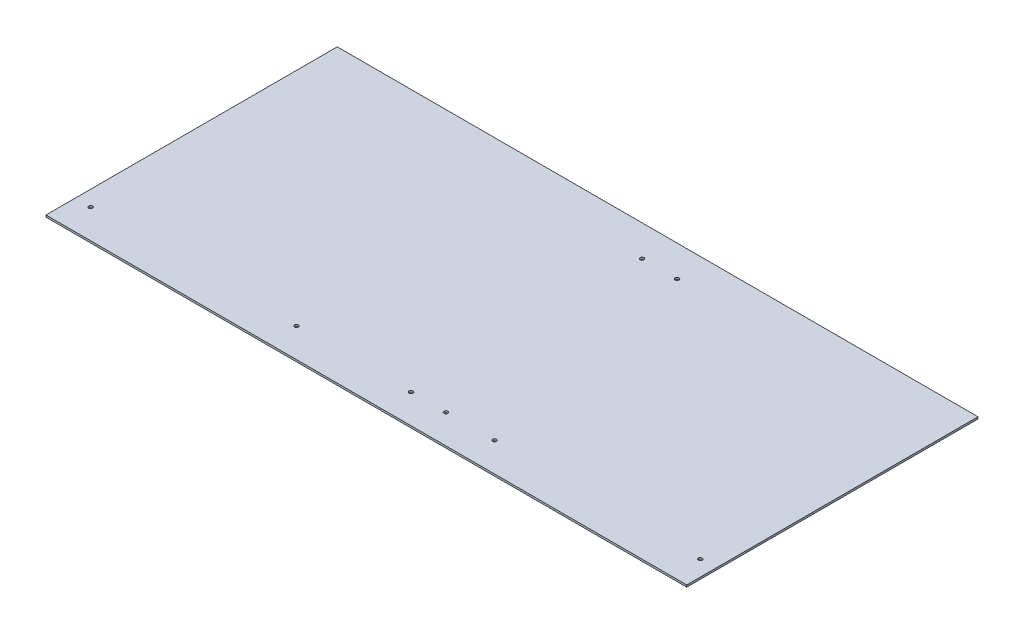
ISO-10303-21;
HEADER;
FILE_DESCRIPTION(('STEP AP214'),'2;1');
FILE_NAME('part.step','',(''),(''),'','','');
FILE_SCHEMA(('AUTOMOTIVE_DESIGN { 1 0 10303 214 1 1 1 1 }'));
ENDSEC;
DATA;
#1=APPLICATION_CONTEXT('core data for automotive mechanical design processes');
#2=APPLICATION_PROTOCOL_DEFINITION('international standard','automotive_design',2000,#1);
#3=PRODUCT_CONTEXT('',#1,'mechanical');
#4=PRODUCT('Part','Part','',(#3));
#5=PRODUCT_RELATED_PRODUCT_CATEGORY('part','',(#4));
#6=PRODUCT_DEFINITION_FORMATION('','',#4);
#7=PRODUCT_DEFINITION_CONTEXT('part definition',#1,'design');
#8=PRODUCT_DEFINITION('design','',#6,#7);
#9=PRODUCT_DEFINITION_SHAPE('','',#8);
#10=(LENGTH_UNIT() NAMED_UNIT(*) SI_UNIT(.MILLI.,.METRE.));
#11=(NAMED_UNIT(*) PLANE_ANGLE_UNIT() SI_UNIT($,.RADIAN.));
#12=(NAMED_UNIT(*) SI_UNIT($,.STERADIAN.) SOLID_ANGLE_UNIT());
#13=UNCERTAINTY_MEASURE_WITH_UNIT(LENGTH_MEASURE(1.E-05),#10,'distance_accuracy_value','');
#14=(GEOMETRIC_REPRESENTATION_CONTEXT(3) GLOBAL_UNCERTAINTY_ASSIGNED_CONTEXT((#13)) GLOBAL_UNIT_ASSIGNED_CONTEXT((#10,
#11,#12)) REPRESENTATION_CONTEXT('',''));
#15=CARTESIAN_POINT('',(0.,0.,0.));
#16=DIRECTION('',(0.,0.,1.));
#17=DIRECTION('',(1.,0.,0.));
#18=AXIS2_PLACEMENT_3D('',#15,#16,#17);
#19=CARTESIAN_POINT('',(5026.025,-3.175,238.125));
#20=DIRECTION('',(0.,-1.,0.));
#21=DIRECTION('',(0.,0.,-1.));
#22=AXIS2_PLACEMENT_3D('',#19,#20,#21);
#23=PLANE('',#22);
#24=DIRECTION('',(0.,0.,1.));
#25=VECTOR('',#24,1.);
#26=CARTESIAN_POINT('',(5549.9,-3.175,238.125));
#27=LINE('',#26,#25);
#28=CARTESIAN_POINT('',(5549.9,-3.175,0.));
#29=VERTEX_POINT('',#28);
#30=CARTESIAN_POINT('',(5549.9,-3.175,476.25));
#31=VERTEX_POINT('',#30);
#32=EDGE_CURVE('E58',#29,#31,#27,.T.);
#33=ORIENTED_EDGE('',*,*,#32,.T.);
#34=DIRECTION('',(1.,0.,0.));
#35=VECTOR('',#34,1.);
#36=CARTESIAN_POINT('',(5026.025,-3.175,476.25));
#37=LINE('',#36,#35);
#38=CARTESIAN_POINT('',(4502.15,-3.175,476.25));
#39=VERTEX_POINT('',#38);
#40=EDGE_CURVE('E50',#39,#31,#37,.T.);
#41=ORIENTED_EDGE('',*,*,#40,.F.);
#42=DIRECTION('',(0.,0.,1.));
#43=VECTOR('',#42,1.);
#44=CARTESIAN_POINT('',(4502.15,-3.175,238.125));
#45=LINE('',#44,#43);
#46=CARTESIAN_POINT('',(4502.15,-3.175,0.));
#47=VERTEX_POINT('',#46);
#48=EDGE_CURVE('E60',#47,#39,#45,.T.);
#49=ORIENTED_EDGE('',*,*,#48,.F.);
#50=DIRECTION('',(1.,0.,0.));
#51=VECTOR('',#50,1.);
#52=CARTESIAN_POINT('',(5026.025,-3.175,0.));
#53=LINE('',#52,#51);
#54=EDGE_CURVE('E55',#47,#29,#53,.T.);
#55=ORIENTED_EDGE('',*,*,#54,.T.);
#56=EDGE_LOOP('',(#33,#41,#49,#55));
#57=FACE_BOUND('',#56,.T.);
#58=CARTESIAN_POINT('',(4527.55,-3.17499999999971,428.625));
#59=DIRECTION('',(0.,-1.,0.));
#60=DIRECTION('',(0.,0.,-1.));
#61=AXIS2_PLACEMENT_3D('',#58,#59,#60);
#62=CIRCLE('',#61,3.175);
#63=CARTESIAN_POINT('',(4527.55,-3.17499999999971,425.45));
#64=VERTEX_POINT('',#63);
#65=EDGE_CURVE('E66',#64,#64,#62,.F.);
#66=ORIENTED_EDGE('',*,*,#65,.T.);
#67=EDGE_LOOP('',(#66));
#68=FACE_BOUND('',#67,.T.);
#69=CARTESIAN_POINT('',(5051.425,-3.17499999999971,428.625));
#70=DIRECTION('',(0.,-1.,0.));
#71=DIRECTION('',(0.,0.,-1.));
#72=AXIS2_PLACEMENT_3D('',#69,#70,#71);
#73=CIRCLE('',#72,3.175);
#74=CARTESIAN_POINT('',(5051.425,-3.17499999999971,425.45));
#75=VERTEX_POINT('',#74);
#76=EDGE_CURVE('E106',#75,#75,#73,.F.);
#77=ORIENTED_EDGE('',*,*,#76,.T.);
#78=EDGE_LOOP('',(#77));
#79=FACE_BOUND('',#78,.T.);
#80=CARTESIAN_POINT('',(5108.575,-3.17499999999971,428.625));
#81=DIRECTION('',(0.,-1.,0.));
#82=DIRECTION('',(0.,0.,-1.));
#83=AXIS2_PLACEMENT_3D('',#80,#81,#82);
#84=CIRCLE('',#83,3.175);
#85=CARTESIAN_POINT('',(5108.575,-3.17499999999971,425.45));
#86=VERTEX_POINT('',#85);
#87=EDGE_CURVE('E109',#86,#86,#84,.F.);
#88=ORIENTED_EDGE('',*,*,#87,.T.);
#89=EDGE_LOOP('',(#88));
#90=FACE_BOUND('',#89,.T.);
#91=CARTESIAN_POINT('',(5524.5,-3.17499999999971,428.625));
#92=DIRECTION('',(0.,-1.,0.));
#93=DIRECTION('',(0.,0.,-1.));
#94=AXIS2_PLACEMENT_3D('',#91,#92,#93);
#95=CIRCLE('',#94,3.175);
#96=CARTESIAN_POINT('',(5524.5,-3.17499999999971,425.45));
#97=VERTEX_POINT('',#96);
#98=EDGE_CURVE('E112',#97,#97,#95,.F.);
#99=ORIENTED_EDGE('',*,*,#98,.T.);
#100=EDGE_LOOP('',(#99));
#101=FACE_BOUND('',#100,.T.);
#102=CARTESIAN_POINT('',(5108.575,-3.17499999999971,50.8));
#103=DIRECTION('',(0.,-1.,0.));
#104=DIRECTION('',(0.,0.,-1.));
#105=AXIS2_PLACEMENT_3D('',#102,#103,#104);
#106=CIRCLE('',#105,3.175);
#107=CARTESIAN_POINT('',(5108.575,-3.17499999999971,47.625));
#108=VERTEX_POINT('',#107);
#109=EDGE_CURVE('E115',#108,#108,#106,.F.);
#110=ORIENTED_EDGE('',*,*,#109,.T.);
#111=EDGE_LOOP('',(#110));
#112=FACE_BOUND('',#111,.T.);
#113=CARTESIAN_POINT('',(5051.425,-3.17499999999971,50.8));
#114=DIRECTION('',(0.,-1.,0.));
#115=DIRECTION('',(0.,0.,-1.));
#116=AXIS2_PLACEMENT_3D('',#113,#114,#115);
#117=CIRCLE('',#116,3.175);
#118=CARTESIAN_POINT('',(5051.425,-3.17499999999971,47.625));
#119=VERTEX_POINT('',#118);
#120=EDGE_CURVE('E118',#119,#119,#117,.F.);
#121=ORIENTED_EDGE('',*,*,#120,.T.);
#122=EDGE_LOOP('',(#121));
#123=FACE_BOUND('',#122,.T.);
#124=CARTESIAN_POINT('',(4864.1,-3.17499999999971,428.625));
#125=DIRECTION('',(0.,-1.,0.));
#126=DIRECTION('',(0.,0.,-1.));
#127=AXIS2_PLACEMENT_3D('',#124,#125,#126);
#128=CIRCLE('',#127,3.175);
#129=CARTESIAN_POINT('',(4864.1,-3.17499999999971,425.45));
#130=VERTEX_POINT('',#129);
#131=EDGE_CURVE('E120',#130,#130,#128,.F.);
#132=ORIENTED_EDGE('',*,*,#131,.T.);
#133=EDGE_LOOP('',(#132));
#134=FACE_BOUND('',#133,.T.);
#135=CARTESIAN_POINT('',(5187.95,-3.17499999999971,428.625));
#136=DIRECTION('',(0.,-1.,0.));
#137=DIRECTION('',(0.,0.,-1.));
#138=AXIS2_PLACEMENT_3D('',#135,#136,#137);
#139=CIRCLE('',#138,3.175);
#140=CARTESIAN_POINT('',(5187.95,-3.17499999999971,425.45));
#141=VERTEX_POINT('',#140);
#142=EDGE_CURVE('E17',#141,#141,#139,.F.);
#143=ORIENTED_EDGE('',*,*,#142,.T.);
#144=EDGE_LOOP('',(#143));
#145=FACE_BOUND('',#144,.T.);
#146=ADVANCED_FACE('F14',(#57,#68,#79,#90,#101,#112,#123,#134,#145),#23,.T.);
#147=CARTESIAN_POINT('',(5187.95,-7227.09274295138,428.625));
#148=DIRECTION('',(0.,-1.,0.));
#149=DIRECTION('',(0.,0.,-1.));
#150=AXIS2_PLACEMENT_3D('',#147,#148,#149);
#151=CYLINDRICAL_SURFACE('',#150,3.175);
#152=CARTESIAN_POINT('',(5187.95,0.,428.625));
#153=DIRECTION('',(0.,-1.,0.));
#154=DIRECTION('',(0.,0.,-1.));
#155=AXIS2_PLACEMENT_3D('',#152,#153,#154);
#156=CIRCLE('',#155,3.175);
#157=CARTESIAN_POINT('',(5187.95,0.,425.45));
#158=VERTEX_POINT('',#157);
#159=EDGE_CURVE('E101',#158,#158,#156,.F.);
#160=ORIENTED_EDGE('',*,*,#159,.T.);
#161=EDGE_LOOP('',(#160));
#162=FACE_BOUND('',#161,.T.);
#163=ORIENTED_EDGE('',*,*,#142,.F.);
#164=EDGE_LOOP('',(#163));
#165=FACE_BOUND('',#164,.T.);
#166=ADVANCED_FACE('F128',(#162,#165),#151,.F.);
#167=CARTESIAN_POINT('',(4864.1,-7227.09274295138,428.625));
#168=DIRECTION('',(0.,-1.,0.));
#169=DIRECTION('',(0.,0.,-1.));
#170=AXIS2_PLACEMENT_3D('',#167,#168,#169);
#171=CYLINDRICAL_SURFACE('',#170,3.175);
#172=CARTESIAN_POINT('',(4864.1,0.,428.625));
#173=DIRECTION('',(0.,-1.,0.));
#174=DIRECTION('',(0.,0.,-1.));
#175=AXIS2_PLACEMENT_3D('',#172,#173,#174);
#176=CIRCLE('',#175,3.175);
#177=CARTESIAN_POINT('',(4864.1,0.,425.45));
#178=VERTEX_POINT('',#177);
#179=EDGE_CURVE('E98',#178,#178,#176,.F.);
#180=ORIENTED_EDGE('',*,*,#179,.T.);
#181=EDGE_LOOP('',(#180));
#182=FACE_BOUND('',#181,.T.);
#183=ORIENTED_EDGE('',*,*,#131,.F.);
#184=EDGE_LOOP('',(#183));
#185=FACE_BOUND('',#184,.T.);
#186=ADVANCED_FACE('F130',(#182,#185),#171,.F.);
#187=CARTESIAN_POINT('',(5051.425,-7227.09274295138,50.8));
#188=DIRECTION('',(0.,-1.,0.));
#189=DIRECTION('',(0.,0.,-1.));
#190=AXIS2_PLACEMENT_3D('',#187,#188,#189);
#191=CYLINDRICAL_SURFACE('',#190,3.175);
#192=CARTESIAN_POINT('',(5051.425,0.,50.8));
#193=DIRECTION('',(0.,-1.,0.));
#194=DIRECTION('',(0.,0.,-1.));
#195=AXIS2_PLACEMENT_3D('',#192,#193,#194);
#196=CIRCLE('',#195,3.175);
#197=CARTESIAN_POINT('',(5051.425,0.,47.625));
#198=VERTEX_POINT('',#197);
#199=EDGE_CURVE('E95',#198,#198,#196,.F.);
#200=ORIENTED_EDGE('',*,*,#199,.T.);
#201=EDGE_LOOP('',(#200));
#202=FACE_BOUND('',#201,.T.);
#203=ORIENTED_EDGE('',*,*,#120,.F.);
#204=EDGE_LOOP('',(#203));
#205=FACE_BOUND('',#204,.T.);
#206=ADVANCED_FACE('F137',(#202,#205),#191,.F.);
#207=CARTESIAN_POINT('',(5108.575,-7227.09274295138,50.8));
#208=DIRECTION('',(0.,-1.,0.));
#209=DIRECTION('',(0.,0.,-1.));
#210=AXIS2_PLACEMENT_3D('',#207,#208,#209);
#211=CYLINDRICAL_SURFACE('',#210,3.175);
#212=CARTESIAN_POINT('',(5108.575,0.,50.8));
#213=DIRECTION('',(0.,-1.,0.));
#214=DIRECTION('',(0.,0.,-1.));
#215=AXIS2_PLACEMENT_3D('',#212,#213,#214);
#216=CIRCLE('',#215,3.175);
#217=CARTESIAN_POINT('',(5108.575,0.,47.625));
#218=VERTEX_POINT('',#217);
#219=EDGE_CURVE('E92',#218,#218,#216,.F.);
#220=ORIENTED_EDGE('',*,*,#219,.T.);
#221=EDGE_LOOP('',(#220));
#222=FACE_BOUND('',#221,.T.);
#223=ORIENTED_EDGE('',*,*,#109,.F.);
#224=EDGE_LOOP('',(#223));
#225=FACE_BOUND('',#224,.T.);
#226=ADVANCED_FACE('F174',(#222,#225),#211,.F.);
#227=CARTESIAN_POINT('',(5524.5,-7227.09274295138,428.625));
#228=DIRECTION('',(0.,-1.,0.));
#229=DIRECTION('',(0.,0.,-1.));
#230=AXIS2_PLACEMENT_3D('',#227,#228,#229);
#231=CYLINDRICAL_SURFACE('',#230,3.175);
#232=CARTESIAN_POINT('',(5524.5,0.,428.625));
#233=DIRECTION('',(0.,-1.,0.));
#234=DIRECTION('',(0.,0.,-1.));
#235=AXIS2_PLACEMENT_3D('',#232,#233,#234);
#236=CIRCLE('',#235,3.175);
#237=CARTESIAN_POINT('',(5524.5,0.,425.45));
#238=VERTEX_POINT('',#237);
#239=EDGE_CURVE('E89',#238,#238,#236,.F.);
#240=ORIENTED_EDGE('',*,*,#239,.T.);
#241=EDGE_LOOP('',(#240));
#242=FACE_BOUND('',#241,.T.);
#243=ORIENTED_EDGE('',*,*,#98,.F.);
#244=EDGE_LOOP('',(#243));
#245=FACE_BOUND('',#244,.T.);
#246=ADVANCED_FACE('F170',(#242,#245),#231,.F.);
#247=CARTESIAN_POINT('',(5108.575,-7227.09274295138,428.625));
#248=DIRECTION('',(0.,-1.,0.));
#249=DIRECTION('',(0.,0.,-1.));
#250=AXIS2_PLACEMENT_3D('',#247,#248,#249);
#251=CYLINDRICAL_SURFACE('',#250,3.175);
#252=CARTESIAN_POINT('',(5108.575,0.,428.625));
#253=DIRECTION('',(0.,-1.,0.));
#254=DIRECTION('',(0.,0.,-1.));
#255=AXIS2_PLACEMENT_3D('',#252,#253,#254);
#256=CIRCLE('',#255,3.175);
#257=CARTESIAN_POINT('',(5108.575,0.,425.45));
#258=VERTEX_POINT('',#257);
#259=EDGE_CURVE('E86',#258,#258,#256,.F.);
#260=ORIENTED_EDGE('',*,*,#259,.T.);
#261=EDGE_LOOP('',(#260));
#262=FACE_BOUND('',#261,.T.);
#263=ORIENTED_EDGE('',*,*,#87,.F.);
#264=EDGE_LOOP('',(#263));
#265=FACE_BOUND('',#264,.T.);
#266=ADVANCED_FACE('F166',(#262,#265),#251,.F.);
#267=CARTESIAN_POINT('',(5051.425,-7227.09274295138,428.625));
#268=DIRECTION('',(0.,-1.,0.));
#269=DIRECTION('',(0.,0.,-1.));
#270=AXIS2_PLACEMENT_3D('',#267,#268,#269);
#271=CYLINDRICAL_SURFACE('',#270,3.175);
#272=CARTESIAN_POINT('',(5051.425,0.,428.625));
#273=DIRECTION('',(0.,-1.,0.));
#274=DIRECTION('',(0.,0.,-1.));
#275=AXIS2_PLACEMENT_3D('',#272,#273,#274);
#276=CIRCLE('',#275,3.175);
#277=CARTESIAN_POINT('',(5051.425,0.,425.45));
#278=VERTEX_POINT('',#277);
#279=EDGE_CURVE('E83',#278,#278,#276,.F.);
#280=ORIENTED_EDGE('',*,*,#279,.T.);
#281=EDGE_LOOP('',(#280));
#282=FACE_BOUND('',#281,.T.);
#283=ORIENTED_EDGE('',*,*,#76,.F.);
#284=EDGE_LOOP('',(#283));
#285=FACE_BOUND('',#284,.T.);
#286=ADVANCED_FACE('F162',(#282,#285),#271,.F.);
#287=CARTESIAN_POINT('',(4527.55,-7227.09274295138,428.625));
#288=DIRECTION('',(0.,-1.,0.));
#289=DIRECTION('',(0.,0.,-1.));
#290=AXIS2_PLACEMENT_3D('',#287,#288,#289);
#291=CYLINDRICAL_SURFACE('',#290,3.175);
#292=CARTESIAN_POINT('',(4527.55,0.,428.625));
#293=DIRECTION('',(0.,-1.,0.));
#294=DIRECTION('',(0.,0.,-1.));
#295=AXIS2_PLACEMENT_3D('',#292,#293,#294);
#296=CIRCLE('',#295,3.175);
#297=CARTESIAN_POINT('',(4527.55,0.,425.45));
#298=VERTEX_POINT('',#297);
#299=EDGE_CURVE('E80',#298,#298,#296,.F.);
#300=ORIENTED_EDGE('',*,*,#299,.T.);
#301=EDGE_LOOP('',(#300));
#302=FACE_BOUND('',#301,.T.);
#303=ORIENTED_EDGE('',*,*,#65,.F.);
#304=EDGE_LOOP('',(#303));
#305=FACE_BOUND('',#304,.T.);
#306=ADVANCED_FACE('F159',(#302,#305),#291,.F.);
#307=CARTESIAN_POINT('',(5026.025,-3.175,0.));
#308=DIRECTION('',(0.,0.,1.));
#309=DIRECTION('',(1.,0.,0.));
#310=AXIS2_PLACEMENT_3D('',#307,#308,#309);
#311=PLANE('',#310);
#312=DIRECTION('',(0.,1.,0.));
#313=VECTOR('',#312,1.);
#314=CARTESIAN_POINT('',(5549.9,-3.175,0.));
#315=LINE('',#314,#313);
#316=CARTESIAN_POINT('',(5549.9,0.,0.));
#317=VERTEX_POINT('',#316);
#318=EDGE_CURVE('E65',#317,#29,#315,.F.);
#319=ORIENTED_EDGE('',*,*,#318,.T.);
#320=ORIENTED_EDGE('',*,*,#54,.F.);
#321=DIRECTION('',(0.,1.,0.));
#322=VECTOR('',#321,1.);
#323=CARTESIAN_POINT('',(4502.15,-3.175,0.));
#324=LINE('',#323,#322);
#325=CARTESIAN_POINT('',(4502.15,0.,0.));
#326=VERTEX_POINT('',#325);
#327=EDGE_CURVE('E309',#326,#47,#324,.F.);
#328=ORIENTED_EDGE('',*,*,#327,.F.);
#329=DIRECTION('',(1.,0.,0.));
#330=VECTOR('',#329,1.);
#331=CARTESIAN_POINT('',(5026.025,0.,0.));
#332=LINE('',#331,#330);
#333=EDGE_CURVE('E76',#326,#317,#332,.T.);
#334=ORIENTED_EDGE('',*,*,#333,.T.);
#335=EDGE_LOOP('',(#319,#320,#328,#334));
#336=FACE_BOUND('',#335,.T.);
#337=ADVANCED_FACE('F75',(#336),#311,.F.);
#338=CARTESIAN_POINT('',(5549.9,-3.175,238.125));
#339=DIRECTION('',(-1.,0.,0.));
#340=DIRECTION('',(0.,0.,1.));
#341=AXIS2_PLACEMENT_3D('',#338,#339,#340);
#342=PLANE('',#341);
#343=DIRECTION('',(0.,1.,0.));
#344=VECTOR('',#343,1.);
#345=CARTESIAN_POINT('',(5549.9,-3.175,476.25));
#346=LINE('',#345,#344);
#347=CARTESIAN_POINT('',(5549.9,0.,476.25));
#348=VERTEX_POINT('',#347);
#349=EDGE_CURVE('E72',#31,#348,#346,.T.);
#350=ORIENTED_EDGE('',*,*,#349,.F.);
#351=ORIENTED_EDGE('',*,*,#32,.F.);
#352=ORIENTED_EDGE('',*,*,#318,.F.);
#353=DIRECTION('',(0.,0.,-1.));
#354=VECTOR('',#353,1.);
#355=CARTESIAN_POINT('',(5549.9,0.,238.125));
#356=LINE('',#355,#354);
#357=EDGE_CURVE('E302',#317,#348,#356,.F.);
#358=ORIENTED_EDGE('',*,*,#357,.T.);
#359=EDGE_LOOP('',(#350,#351,#352,#358));
#360=FACE_BOUND('',#359,.T.);
#361=ADVANCED_FACE('F69',(#360),#342,.F.);
#362=CARTESIAN_POINT('',(5026.025,-3.175,476.25));
#363=DIRECTION('',(0.,0.,1.));
#364=DIRECTION('',(1.,0.,0.));
#365=AXIS2_PLACEMENT_3D('',#362,#363,#364);
#366=PLANE('',#365);
#367=ORIENTED_EDGE('',*,*,#40,.T.);
#368=ORIENTED_EDGE('',*,*,#349,.T.);
#369=DIRECTION('',(1.,0.,0.));
#370=VECTOR('',#369,1.);
#371=CARTESIAN_POINT('',(5026.025,0.,476.25));
#372=LINE('',#371,#370);
#373=CARTESIAN_POINT('',(4502.15,0.,476.25));
#374=VERTEX_POINT('',#373);
#375=EDGE_CURVE('E23',#348,#374,#372,.F.);
#376=ORIENTED_EDGE('',*,*,#375,.T.);
#377=DIRECTION('',(0.,1.,0.));
#378=VECTOR('',#377,1.);
#379=CARTESIAN_POINT('',(4502.15,-3.175,476.25));
#380=LINE('',#379,#378);
#381=EDGE_CURVE('E31',#39,#374,#380,.T.);
#382=ORIENTED_EDGE('',*,*,#381,.F.);
#383=EDGE_LOOP('',(#367,#368,#376,#382));
#384=FACE_BOUND('',#383,.T.);
#385=ADVANCED_FACE('F148',(#384),#366,.T.);
#386=CARTESIAN_POINT('',(4502.15,-3.175,238.125));
#387=DIRECTION('',(-1.,0.,0.));
#388=DIRECTION('',(0.,0.,1.));
#389=AXIS2_PLACEMENT_3D('',#386,#387,#388);
#390=PLANE('',#389);
#391=ORIENTED_EDGE('',*,*,#48,.T.);
#392=ORIENTED_EDGE('',*,*,#381,.T.);
#393=DIRECTION('',(0.,0.,-1.));
#394=VECTOR('',#393,1.);
#395=CARTESIAN_POINT('',(4502.15,0.,238.125));
#396=LINE('',#395,#394);
#397=EDGE_CURVE('E9',#374,#326,#396,.T.);
#398=ORIENTED_EDGE('',*,*,#397,.T.);
#399=ORIENTED_EDGE('',*,*,#327,.T.);
#400=EDGE_LOOP('',(#391,#392,#398,#399));
#401=FACE_BOUND('',#400,.T.);
#402=ADVANCED_FACE('F142',(#401),#390,.T.);
#403=CARTESIAN_POINT('',(5026.025,0.,238.125));
#404=DIRECTION('',(0.,-1.,0.));
#405=DIRECTION('',(0.,0.,-1.));
#406=AXIS2_PLACEMENT_3D('',#403,#404,#405);
#407=PLANE('',#406);
#408=ORIENTED_EDGE('',*,*,#375,.F.);
#409=ORIENTED_EDGE('',*,*,#357,.F.);
#410=ORIENTED_EDGE('',*,*,#333,.F.);
#411=ORIENTED_EDGE('',*,*,#397,.F.);
#412=EDGE_LOOP('',(#408,#409,#410,#411));
#413=FACE_BOUND('',#412,.T.);
#414=ORIENTED_EDGE('',*,*,#299,.F.);
#415=EDGE_LOOP('',(#414));
#416=FACE_BOUND('',#415,.T.);
#417=ORIENTED_EDGE('',*,*,#279,.F.);
#418=EDGE_LOOP('',(#417));
#419=FACE_BOUND('',#418,.T.);
#420=ORIENTED_EDGE('',*,*,#259,.F.);
#421=EDGE_LOOP('',(#420));
#422=FACE_BOUND('',#421,.T.);
#423=ORIENTED_EDGE('',*,*,#239,.F.);
#424=EDGE_LOOP('',(#423));
#425=FACE_BOUND('',#424,.T.);
#426=ORIENTED_EDGE('',*,*,#219,.F.);
#427=EDGE_LOOP('',(#426));
#428=FACE_BOUND('',#427,.T.);
#429=ORIENTED_EDGE('',*,*,#199,.F.);
#430=EDGE_LOOP('',(#429));
#431=FACE_BOUND('',#430,.T.);
#432=ORIENTED_EDGE('',*,*,#179,.F.);
#433=EDGE_LOOP('',(#432));
#434=FACE_BOUND('',#433,.T.);
#435=ORIENTED_EDGE('',*,*,#159,.F.);
#436=EDGE_LOOP('',(#435));
#437=FACE_BOUND('',#436,.T.);
#438=ADVANCED_FACE('F140',(#413,#416,#419,#422,#425,#428,#431,#434,#437),#407,.F.);
#439=CLOSED_SHELL('',(#146,#166,#186,#206,#226,#246,#266,#286,#306,#337,#361,#385,#402,#438));
#440=MANIFOLD_SOLID_BREP('B1',#439);
#441=ADVANCED_BREP_SHAPE_REPRESENTATION('',(#18,#440),#14);
#442=SHAPE_DEFINITION_REPRESENTATION(#9,#441);
ENDSEC;
END-ISO-10303-21;
